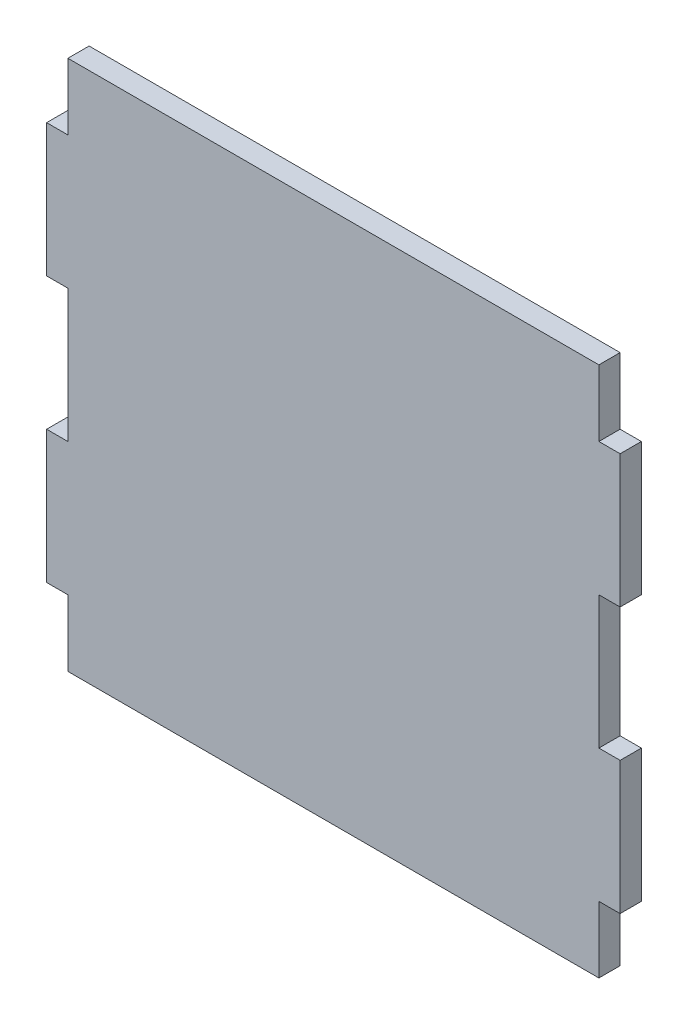
ISO-10303-21;
HEADER;
FILE_DESCRIPTION(('STEP AP214'),'2;1');
FILE_NAME('part.step','',(''),(''),'','','');
FILE_SCHEMA(('AUTOMOTIVE_DESIGN { 1 0 10303 214 1 1 1 1 }'));
ENDSEC;
DATA;
#1=APPLICATION_CONTEXT('core data for automotive mechanical design processes');
#2=APPLICATION_PROTOCOL_DEFINITION('international standard','automotive_design',2000,#1);
#3=PRODUCT_CONTEXT('',#1,'mechanical');
#4=PRODUCT('Part','Part','',(#3));
#5=PRODUCT_RELATED_PRODUCT_CATEGORY('part','',(#4));
#6=PRODUCT_DEFINITION_FORMATION('','',#4);
#7=PRODUCT_DEFINITION_CONTEXT('part definition',#1,'design');
#8=PRODUCT_DEFINITION('design','',#6,#7);
#9=PRODUCT_DEFINITION_SHAPE('','',#8);
#10=(LENGTH_UNIT() NAMED_UNIT(*) SI_UNIT(.MILLI.,.METRE.));
#11=(NAMED_UNIT(*) PLANE_ANGLE_UNIT() SI_UNIT($,.RADIAN.));
#12=(NAMED_UNIT(*) SI_UNIT($,.STERADIAN.) SOLID_ANGLE_UNIT());
#13=UNCERTAINTY_MEASURE_WITH_UNIT(LENGTH_MEASURE(1.E-05),#10,'distance_accuracy_value','');
#14=(GEOMETRIC_REPRESENTATION_CONTEXT(3) GLOBAL_UNCERTAINTY_ASSIGNED_CONTEXT((#13)) GLOBAL_UNIT_ASSIGNED_CONTEXT((#10,
#11,#12)) REPRESENTATION_CONTEXT('',''));
#15=CARTESIAN_POINT('',(0.,0.,0.));
#16=DIRECTION('',(0.,0.,1.));
#17=DIRECTION('',(1.,0.,0.));
#18=AXIS2_PLACEMENT_3D('',#15,#16,#17);
#19=CARTESIAN_POINT('',(0.,0.,4.));
#20=DIRECTION('',(1.,0.,0.));
#21=DIRECTION('',(0.,0.,-1.));
#22=AXIS2_PLACEMENT_3D('',#19,#20,#21);
#23=PLANE('',#22);
#24=DIRECTION('',(0.,-1.,0.));
#25=VECTOR('',#24,1.);
#26=CARTESIAN_POINT('',(0.,0.,0.));
#27=LINE('',#26,#25);
#28=CARTESIAN_POINT('',(0.,0.,0.));
#29=VERTEX_POINT('',#28);
#30=CARTESIAN_POINT('',(0.,-12.5,0.));
#31=VERTEX_POINT('',#30);
#32=EDGE_CURVE('E201',#29,#31,#27,.T.);
#33=ORIENTED_EDGE('',*,*,#32,.T.);
#34=DIRECTION('',(0.,0.,-1.));
#35=VECTOR('',#34,1.);
#36=CARTESIAN_POINT('',(0.,-12.5,4.));
#37=LINE('',#36,#35);
#38=CARTESIAN_POINT('',(0.,-12.5,4.));
#39=VERTEX_POINT('',#38);
#40=EDGE_CURVE('E11',#39,#31,#37,.T.);
#41=ORIENTED_EDGE('',*,*,#40,.F.);
#42=DIRECTION('',(0.,-1.,0.));
#43=VECTOR('',#42,1.);
#44=CARTESIAN_POINT('',(0.,0.,4.));
#45=LINE('',#44,#43);
#46=CARTESIAN_POINT('',(0.,0.,4.));
#47=VERTEX_POINT('',#46);
#48=EDGE_CURVE('E239',#47,#39,#45,.T.);
#49=ORIENTED_EDGE('',*,*,#48,.F.);
#50=DIRECTION('',(0.,0.,-1.));
#51=VECTOR('',#50,1.);
#52=CARTESIAN_POINT('',(0.,0.,4.));
#53=LINE('',#52,#51);
#54=EDGE_CURVE('E197',#47,#29,#53,.T.);
#55=ORIENTED_EDGE('',*,*,#54,.T.);
#56=EDGE_LOOP('',(#33,#41,#49,#55));
#57=FACE_BOUND('',#56,.T.);
#58=ADVANCED_FACE('F33',(#57),#23,.F.);
#59=CARTESIAN_POINT('',(0.,-12.5,4.));
#60=DIRECTION('',(0.,-1.,0.));
#61=DIRECTION('',(1.,0.,0.));
#62=AXIS2_PLACEMENT_3D('',#59,#60,#61);
#63=PLANE('',#62);
#64=DIRECTION('',(-1.,0.,0.));
#65=VECTOR('',#64,1.);
#66=CARTESIAN_POINT('',(0.,-12.5,0.));
#67=LINE('',#66,#65);
#68=CARTESIAN_POINT('',(-4.,-12.5,0.));
#69=VERTEX_POINT('',#68);
#70=EDGE_CURVE('E204',#31,#69,#67,.T.);
#71=ORIENTED_EDGE('',*,*,#70,.T.);
#72=DIRECTION('',(0.,0.,-1.));
#73=VECTOR('',#72,1.);
#74=CARTESIAN_POINT('',(-4.,-12.5,4.));
#75=LINE('',#74,#73);
#76=CARTESIAN_POINT('',(-4.,-12.5,4.));
#77=VERTEX_POINT('',#76);
#78=EDGE_CURVE('E41',#77,#69,#75,.T.);
#79=ORIENTED_EDGE('',*,*,#78,.F.);
#80=DIRECTION('',(-1.,0.,0.));
#81=VECTOR('',#80,1.);
#82=CARTESIAN_POINT('',(0.,-12.5,4.));
#83=LINE('',#82,#81);
#84=EDGE_CURVE('E128',#39,#77,#83,.T.);
#85=ORIENTED_EDGE('',*,*,#84,.F.);
#86=ORIENTED_EDGE('',*,*,#40,.T.);
#87=EDGE_LOOP('',(#71,#79,#85,#86));
#88=FACE_BOUND('',#87,.T.);
#89=ADVANCED_FACE('F357',(#88),#63,.F.);
#90=CARTESIAN_POINT('',(-4.,-12.5,4.));
#91=DIRECTION('',(1.,0.,0.));
#92=DIRECTION('',(0.,1.,0.));
#93=AXIS2_PLACEMENT_3D('',#90,#91,#92);
#94=PLANE('',#93);
#95=DIRECTION('',(0.,-1.,0.));
#96=VECTOR('',#95,1.);
#97=CARTESIAN_POINT('',(-4.,-12.5,0.));
#98=LINE('',#97,#96);
#99=CARTESIAN_POINT('',(-4.,-37.5,0.));
#100=VERTEX_POINT('',#99);
#101=EDGE_CURVE('E206',#69,#100,#98,.T.);
#102=ORIENTED_EDGE('',*,*,#101,.T.);
#103=DIRECTION('',(0.,0.,-1.));
#104=VECTOR('',#103,1.);
#105=CARTESIAN_POINT('',(-4.,-37.5,4.));
#106=LINE('',#105,#104);
#107=CARTESIAN_POINT('',(-4.,-37.5,4.));
#108=VERTEX_POINT('',#107);
#109=EDGE_CURVE('E282',#108,#100,#106,.T.);
#110=ORIENTED_EDGE('',*,*,#109,.F.);
#111=DIRECTION('',(0.,-1.,0.));
#112=VECTOR('',#111,1.);
#113=CARTESIAN_POINT('',(-4.,-12.5,4.));
#114=LINE('',#113,#112);
#115=EDGE_CURVE('E290',#77,#108,#114,.T.);
#116=ORIENTED_EDGE('',*,*,#115,.F.);
#117=ORIENTED_EDGE('',*,*,#78,.T.);
#118=EDGE_LOOP('',(#102,#110,#116,#117));
#119=FACE_BOUND('',#118,.T.);
#120=ADVANCED_FACE('F288',(#119),#94,.F.);
#121=CARTESIAN_POINT('',(0.,-37.5,4.));
#122=DIRECTION('',(0.,1.,0.));
#123=DIRECTION('',(0.,0.,1.));
#124=AXIS2_PLACEMENT_3D('',#121,#122,#123);
#125=PLANE('',#124);
#126=DIRECTION('',(1.,0.,0.));
#127=VECTOR('',#126,1.);
#128=CARTESIAN_POINT('',(0.,-37.5,0.));
#129=LINE('',#128,#127);
#130=CARTESIAN_POINT('',(0.,-37.5,0.));
#131=VERTEX_POINT('',#130);
#132=EDGE_CURVE('E208',#100,#131,#129,.T.);
#133=ORIENTED_EDGE('',*,*,#132,.T.);
#134=DIRECTION('',(0.,0.,-1.));
#135=VECTOR('',#134,1.);
#136=CARTESIAN_POINT('',(0.,-37.5,4.));
#137=LINE('',#136,#135);
#138=CARTESIAN_POINT('',(0.,-37.5,4.));
#139=VERTEX_POINT('',#138);
#140=EDGE_CURVE('E279',#139,#131,#137,.T.);
#141=ORIENTED_EDGE('',*,*,#140,.F.);
#142=DIRECTION('',(1.,0.,0.));
#143=VECTOR('',#142,1.);
#144=CARTESIAN_POINT('',(0.,-37.5,4.));
#145=LINE('',#144,#143);
#146=EDGE_CURVE('E308',#108,#139,#145,.T.);
#147=ORIENTED_EDGE('',*,*,#146,.F.);
#148=ORIENTED_EDGE('',*,*,#109,.T.);
#149=EDGE_LOOP('',(#133,#141,#147,#148));
#150=FACE_BOUND('',#149,.T.);
#151=ADVANCED_FACE('F299',(#150),#125,.F.);
#152=CARTESIAN_POINT('',(0.,-37.5,4.));
#153=DIRECTION('',(1.,0.,0.));
#154=DIRECTION('',(0.,1.,0.));
#155=AXIS2_PLACEMENT_3D('',#152,#153,#154);
#156=PLANE('',#155);
#157=DIRECTION('',(0.,-1.,0.));
#158=VECTOR('',#157,1.);
#159=CARTESIAN_POINT('',(0.,-37.5,0.));
#160=LINE('',#159,#158);
#161=CARTESIAN_POINT('',(0.,-62.5,0.));
#162=VERTEX_POINT('',#161);
#163=EDGE_CURVE('E210',#131,#162,#160,.T.);
#164=ORIENTED_EDGE('',*,*,#163,.T.);
#165=DIRECTION('',(0.,0.,-1.));
#166=VECTOR('',#165,1.);
#167=CARTESIAN_POINT('',(0.,-62.5,4.));
#168=LINE('',#167,#166);
#169=CARTESIAN_POINT('',(0.,-62.5,4.));
#170=VERTEX_POINT('',#169);
#171=EDGE_CURVE('E276',#170,#162,#168,.T.);
#172=ORIENTED_EDGE('',*,*,#171,.F.);
#173=DIRECTION('',(0.,-1.,0.));
#174=VECTOR('',#173,1.);
#175=CARTESIAN_POINT('',(0.,-37.5,4.));
#176=LINE('',#175,#174);
#177=EDGE_CURVE('E305',#139,#170,#176,.T.);
#178=ORIENTED_EDGE('',*,*,#177,.F.);
#179=ORIENTED_EDGE('',*,*,#140,.T.);
#180=EDGE_LOOP('',(#164,#172,#178,#179));
#181=FACE_BOUND('',#180,.T.);
#182=ADVANCED_FACE('F303',(#181),#156,.F.);
#183=CARTESIAN_POINT('',(0.,-62.5,4.));
#184=DIRECTION('',(0.,-1.,0.));
#185=DIRECTION('',(0.,0.,-1.));
#186=AXIS2_PLACEMENT_3D('',#183,#184,#185);
#187=PLANE('',#186);
#188=DIRECTION('',(-1.,0.,0.));
#189=VECTOR('',#188,1.);
#190=CARTESIAN_POINT('',(0.,-62.5,0.));
#191=LINE('',#190,#189);
#192=CARTESIAN_POINT('',(-3.99999999999999,-62.5,0.));
#193=VERTEX_POINT('',#192);
#194=EDGE_CURVE('E212',#162,#193,#191,.T.);
#195=ORIENTED_EDGE('',*,*,#194,.T.);
#196=DIRECTION('',(0.,0.,-1.));
#197=VECTOR('',#196,1.);
#198=CARTESIAN_POINT('',(-3.99999999999999,-62.5,4.));
#199=LINE('',#198,#197);
#200=CARTESIAN_POINT('',(-3.99999999999999,-62.5,4.));
#201=VERTEX_POINT('',#200);
#202=EDGE_CURVE('E273',#201,#193,#199,.T.);
#203=ORIENTED_EDGE('',*,*,#202,.F.);
#204=DIRECTION('',(-1.,0.,0.));
#205=VECTOR('',#204,1.);
#206=CARTESIAN_POINT('',(0.,-62.5,4.));
#207=LINE('',#206,#205);
#208=EDGE_CURVE('E307',#170,#201,#207,.T.);
#209=ORIENTED_EDGE('',*,*,#208,.F.);
#210=ORIENTED_EDGE('',*,*,#171,.T.);
#211=EDGE_LOOP('',(#195,#203,#209,#210));
#212=FACE_BOUND('',#211,.T.);
#213=ADVANCED_FACE('F370',(#212),#187,.F.);
#214=CARTESIAN_POINT('',(-3.99999999999999,-62.5,4.));
#215=DIRECTION('',(1.,0.,0.));
#216=DIRECTION('',(0.,1.,0.));
#217=AXIS2_PLACEMENT_3D('',#214,#215,#216);
#218=PLANE('',#217);
#219=DIRECTION('',(0.,-1.,0.));
#220=VECTOR('',#219,1.);
#221=CARTESIAN_POINT('',(-3.99999999999999,-62.5,0.));
#222=LINE('',#221,#220);
#223=CARTESIAN_POINT('',(-3.99999999999999,-87.5,0.));
#224=VERTEX_POINT('',#223);
#225=EDGE_CURVE('E214',#193,#224,#222,.T.);
#226=ORIENTED_EDGE('',*,*,#225,.T.);
#227=DIRECTION('',(0.,0.,-1.));
#228=VECTOR('',#227,1.);
#229=CARTESIAN_POINT('',(-3.99999999999999,-87.5,4.));
#230=LINE('',#229,#228);
#231=CARTESIAN_POINT('',(-3.99999999999999,-87.5,4.));
#232=VERTEX_POINT('',#231);
#233=EDGE_CURVE('E270',#232,#224,#230,.T.);
#234=ORIENTED_EDGE('',*,*,#233,.F.);
#235=DIRECTION('',(0.,-1.,0.));
#236=VECTOR('',#235,1.);
#237=CARTESIAN_POINT('',(-3.99999999999999,-62.5,4.));
#238=LINE('',#237,#236);
#239=EDGE_CURVE('E310',#201,#232,#238,.T.);
#240=ORIENTED_EDGE('',*,*,#239,.F.);
#241=ORIENTED_EDGE('',*,*,#202,.T.);
#242=EDGE_LOOP('',(#226,#234,#240,#241));
#243=FACE_BOUND('',#242,.T.);
#244=ADVANCED_FACE('F373',(#243),#218,.F.);
#245=CARTESIAN_POINT('',(0.,-87.5,4.));
#246=DIRECTION('',(0.,1.,0.));
#247=DIRECTION('',(0.,0.,1.));
#248=AXIS2_PLACEMENT_3D('',#245,#246,#247);
#249=PLANE('',#248);
#250=DIRECTION('',(1.,0.,0.));
#251=VECTOR('',#250,1.);
#252=CARTESIAN_POINT('',(0.,-87.5,0.));
#253=LINE('',#252,#251);
#254=CARTESIAN_POINT('',(0.,-87.5,0.));
#255=VERTEX_POINT('',#254);
#256=EDGE_CURVE('E216',#224,#255,#253,.T.);
#257=ORIENTED_EDGE('',*,*,#256,.T.);
#258=DIRECTION('',(0.,0.,-1.));
#259=VECTOR('',#258,1.);
#260=CARTESIAN_POINT('',(0.,-87.5,4.));
#261=LINE('',#260,#259);
#262=CARTESIAN_POINT('',(0.,-87.5,4.));
#263=VERTEX_POINT('',#262);
#264=EDGE_CURVE('E267',#263,#255,#261,.T.);
#265=ORIENTED_EDGE('',*,*,#264,.F.);
#266=DIRECTION('',(1.,0.,0.));
#267=VECTOR('',#266,1.);
#268=CARTESIAN_POINT('',(0.,-87.5,4.));
#269=LINE('',#268,#267);
#270=EDGE_CURVE('E316',#232,#263,#269,.T.);
#271=ORIENTED_EDGE('',*,*,#270,.F.);
#272=ORIENTED_EDGE('',*,*,#233,.T.);
#273=EDGE_LOOP('',(#257,#265,#271,#272));
#274=FACE_BOUND('',#273,.T.);
#275=ADVANCED_FACE('F377',(#274),#249,.F.);
#276=CARTESIAN_POINT('',(0.,-87.5,4.));
#277=DIRECTION('',(1.,0.,0.));
#278=DIRECTION('',(0.,1.,0.));
#279=AXIS2_PLACEMENT_3D('',#276,#277,#278);
#280=PLANE('',#279);
#281=DIRECTION('',(0.,-1.,0.));
#282=VECTOR('',#281,1.);
#283=CARTESIAN_POINT('',(0.,-87.5,0.));
#284=LINE('',#283,#282);
#285=CARTESIAN_POINT('',(0.,-100.,0.));
#286=VERTEX_POINT('',#285);
#287=EDGE_CURVE('E218',#255,#286,#284,.T.);
#288=ORIENTED_EDGE('',*,*,#287,.T.);
#289=DIRECTION('',(0.,0.,-1.));
#290=VECTOR('',#289,1.);
#291=CARTESIAN_POINT('',(0.,-100.,4.));
#292=LINE('',#291,#290);
#293=CARTESIAN_POINT('',(0.,-100.,4.));
#294=VERTEX_POINT('',#293);
#295=EDGE_CURVE('E264',#294,#286,#292,.T.);
#296=ORIENTED_EDGE('',*,*,#295,.F.);
#297=DIRECTION('',(0.,-1.,0.));
#298=VECTOR('',#297,1.);
#299=CARTESIAN_POINT('',(0.,-87.5,4.));
#300=LINE('',#299,#298);
#301=EDGE_CURVE('E318',#263,#294,#300,.T.);
#302=ORIENTED_EDGE('',*,*,#301,.F.);
#303=ORIENTED_EDGE('',*,*,#264,.T.);
#304=EDGE_LOOP('',(#288,#296,#302,#303));
#305=FACE_BOUND('',#304,.T.);
#306=ADVANCED_FACE('F381',(#305),#280,.F.);
#307=CARTESIAN_POINT('',(0.,-100.,4.));
#308=DIRECTION('',(0.,1.,0.));
#309=DIRECTION('',(0.,0.,1.));
#310=AXIS2_PLACEMENT_3D('',#307,#308,#309);
#311=PLANE('',#310);
#312=DIRECTION('',(1.,0.,0.));
#313=VECTOR('',#312,1.);
#314=CARTESIAN_POINT('',(0.,-100.,0.));
#315=LINE('',#314,#313);
#316=CARTESIAN_POINT('',(100.,-100.,0.));
#317=VERTEX_POINT('',#316);
#318=EDGE_CURVE('E220',#286,#317,#315,.T.);
#319=ORIENTED_EDGE('',*,*,#318,.T.);
#320=DIRECTION('',(0.,0.,-1.));
#321=VECTOR('',#320,1.);
#322=CARTESIAN_POINT('',(100.,-100.,4.));
#323=LINE('',#322,#321);
#324=CARTESIAN_POINT('',(100.,-100.,4.));
#325=VERTEX_POINT('',#324);
#326=EDGE_CURVE('E261',#325,#317,#323,.T.);
#327=ORIENTED_EDGE('',*,*,#326,.F.);
#328=DIRECTION('',(1.,0.,0.));
#329=VECTOR('',#328,1.);
#330=CARTESIAN_POINT('',(0.,-100.,4.));
#331=LINE('',#330,#329);
#332=EDGE_CURVE('E320',#294,#325,#331,.T.);
#333=ORIENTED_EDGE('',*,*,#332,.F.);
#334=ORIENTED_EDGE('',*,*,#295,.T.);
#335=EDGE_LOOP('',(#319,#327,#333,#334));
#336=FACE_BOUND('',#335,.T.);
#337=ADVANCED_FACE('F385',(#336),#311,.F.);
#338=CARTESIAN_POINT('',(100.,-87.5,4.));
#339=DIRECTION('',(-1.,0.,0.));
#340=DIRECTION('',(0.,-1.,0.));
#341=AXIS2_PLACEMENT_3D('',#338,#339,#340);
#342=PLANE('',#341);
#343=DIRECTION('',(0.,1.,0.));
#344=VECTOR('',#343,1.);
#345=CARTESIAN_POINT('',(100.,-87.5,0.));
#346=LINE('',#345,#344);
#347=CARTESIAN_POINT('',(100.,-87.5,0.));
#348=VERTEX_POINT('',#347);
#349=EDGE_CURVE('E222',#317,#348,#346,.T.);
#350=ORIENTED_EDGE('',*,*,#349,.T.);
#351=DIRECTION('',(0.,0.,-1.));
#352=VECTOR('',#351,1.);
#353=CARTESIAN_POINT('',(100.,-87.5,4.));
#354=LINE('',#353,#352);
#355=CARTESIAN_POINT('',(100.,-87.5,4.));
#356=VERTEX_POINT('',#355);
#357=EDGE_CURVE('E258',#356,#348,#354,.T.);
#358=ORIENTED_EDGE('',*,*,#357,.F.);
#359=DIRECTION('',(0.,1.,0.));
#360=VECTOR('',#359,1.);
#361=CARTESIAN_POINT('',(100.,-87.5,4.));
#362=LINE('',#361,#360);
#363=EDGE_CURVE('E322',#325,#356,#362,.T.);
#364=ORIENTED_EDGE('',*,*,#363,.F.);
#365=ORIENTED_EDGE('',*,*,#326,.T.);
#366=EDGE_LOOP('',(#350,#358,#364,#365));
#367=FACE_BOUND('',#366,.T.);
#368=ADVANCED_FACE('F389',(#367),#342,.F.);
#369=CARTESIAN_POINT('',(100.,-87.5,4.));
#370=DIRECTION('',(0.,1.,0.));
#371=DIRECTION('',(0.,0.,1.));
#372=AXIS2_PLACEMENT_3D('',#369,#370,#371);
#373=PLANE('',#372);
#374=DIRECTION('',(1.,0.,0.));
#375=VECTOR('',#374,1.);
#376=CARTESIAN_POINT('',(100.,-87.5,0.));
#377=LINE('',#376,#375);
#378=CARTESIAN_POINT('',(104.,-87.5,0.));
#379=VERTEX_POINT('',#378);
#380=EDGE_CURVE('E224',#348,#379,#377,.T.);
#381=ORIENTED_EDGE('',*,*,#380,.T.);
#382=DIRECTION('',(0.,0.,-1.));
#383=VECTOR('',#382,1.);
#384=CARTESIAN_POINT('',(104.,-87.5,4.));
#385=LINE('',#384,#383);
#386=CARTESIAN_POINT('',(104.,-87.5,4.));
#387=VERTEX_POINT('',#386);
#388=EDGE_CURVE('E255',#387,#379,#385,.T.);
#389=ORIENTED_EDGE('',*,*,#388,.F.);
#390=DIRECTION('',(1.,0.,0.));
#391=VECTOR('',#390,1.);
#392=CARTESIAN_POINT('',(100.,-87.5,4.));
#393=LINE('',#392,#391);
#394=EDGE_CURVE('E324',#356,#387,#393,.T.);
#395=ORIENTED_EDGE('',*,*,#394,.F.);
#396=ORIENTED_EDGE('',*,*,#357,.T.);
#397=EDGE_LOOP('',(#381,#389,#395,#396));
#398=FACE_BOUND('',#397,.T.);
#399=ADVANCED_FACE('F393',(#398),#373,.F.);
#400=CARTESIAN_POINT('',(104.,-62.5,4.));
#401=DIRECTION('',(-1.,0.,0.));
#402=DIRECTION('',(0.,0.,1.));
#403=AXIS2_PLACEMENT_3D('',#400,#401,#402);
#404=PLANE('',#403);
#405=DIRECTION('',(0.,1.,0.));
#406=VECTOR('',#405,1.);
#407=CARTESIAN_POINT('',(104.,-62.5,0.));
#408=LINE('',#407,#406);
#409=CARTESIAN_POINT('',(104.,-62.5,0.));
#410=VERTEX_POINT('',#409);
#411=EDGE_CURVE('E226',#379,#410,#408,.T.);
#412=ORIENTED_EDGE('',*,*,#411,.T.);
#413=DIRECTION('',(0.,0.,-1.));
#414=VECTOR('',#413,1.);
#415=CARTESIAN_POINT('',(104.,-62.5,4.));
#416=LINE('',#415,#414);
#417=CARTESIAN_POINT('',(104.,-62.5,4.));
#418=VERTEX_POINT('',#417);
#419=EDGE_CURVE('E252',#418,#410,#416,.T.);
#420=ORIENTED_EDGE('',*,*,#419,.F.);
#421=DIRECTION('',(0.,1.,0.));
#422=VECTOR('',#421,1.);
#423=CARTESIAN_POINT('',(104.,-62.5,4.));
#424=LINE('',#423,#422);
#425=EDGE_CURVE('E326',#387,#418,#424,.T.);
#426=ORIENTED_EDGE('',*,*,#425,.F.);
#427=ORIENTED_EDGE('',*,*,#388,.T.);
#428=EDGE_LOOP('',(#412,#420,#426,#427));
#429=FACE_BOUND('',#428,.T.);
#430=ADVANCED_FACE('F397',(#429),#404,.F.);
#431=CARTESIAN_POINT('',(100.,-62.5,4.));
#432=DIRECTION('',(0.,-1.,0.));
#433=DIRECTION('',(0.,0.,-1.));
#434=AXIS2_PLACEMENT_3D('',#431,#432,#433);
#435=PLANE('',#434);
#436=DIRECTION('',(-1.,0.,0.));
#437=VECTOR('',#436,1.);
#438=CARTESIAN_POINT('',(100.,-62.5,0.));
#439=LINE('',#438,#437);
#440=CARTESIAN_POINT('',(100.,-62.5,0.));
#441=VERTEX_POINT('',#440);
#442=EDGE_CURVE('E228',#410,#441,#439,.T.);
#443=ORIENTED_EDGE('',*,*,#442,.T.);
#444=DIRECTION('',(0.,0.,-1.));
#445=VECTOR('',#444,1.);
#446=CARTESIAN_POINT('',(100.,-62.5,4.));
#447=LINE('',#446,#445);
#448=CARTESIAN_POINT('',(100.,-62.5,4.));
#449=VERTEX_POINT('',#448);
#450=EDGE_CURVE('E249',#449,#441,#447,.T.);
#451=ORIENTED_EDGE('',*,*,#450,.F.);
#452=DIRECTION('',(-1.,0.,0.));
#453=VECTOR('',#452,1.);
#454=CARTESIAN_POINT('',(100.,-62.5,4.));
#455=LINE('',#454,#453);
#456=EDGE_CURVE('E328',#418,#449,#455,.T.);
#457=ORIENTED_EDGE('',*,*,#456,.F.);
#458=ORIENTED_EDGE('',*,*,#419,.T.);
#459=EDGE_LOOP('',(#443,#451,#457,#458));
#460=FACE_BOUND('',#459,.T.);
#461=ADVANCED_FACE('F401',(#460),#435,.F.);
#462=CARTESIAN_POINT('',(100.,-37.5,4.));
#463=DIRECTION('',(-1.,0.,0.));
#464=DIRECTION('',(0.,0.,1.));
#465=AXIS2_PLACEMENT_3D('',#462,#463,#464);
#466=PLANE('',#465);
#467=DIRECTION('',(0.,1.,0.));
#468=VECTOR('',#467,1.);
#469=CARTESIAN_POINT('',(100.,-37.5,0.));
#470=LINE('',#469,#468);
#471=CARTESIAN_POINT('',(100.,-37.5,0.));
#472=VERTEX_POINT('',#471);
#473=EDGE_CURVE('E230',#441,#472,#470,.T.);
#474=ORIENTED_EDGE('',*,*,#473,.T.);
#475=DIRECTION('',(0.,0.,-1.));
#476=VECTOR('',#475,1.);
#477=CARTESIAN_POINT('',(100.,-37.5,4.));
#478=LINE('',#477,#476);
#479=CARTESIAN_POINT('',(100.,-37.5,4.));
#480=VERTEX_POINT('',#479);
#481=EDGE_CURVE('E246',#480,#472,#478,.T.);
#482=ORIENTED_EDGE('',*,*,#481,.F.);
#483=DIRECTION('',(0.,1.,0.));
#484=VECTOR('',#483,1.);
#485=CARTESIAN_POINT('',(100.,-37.5,4.));
#486=LINE('',#485,#484);
#487=EDGE_CURVE('E330',#449,#480,#486,.T.);
#488=ORIENTED_EDGE('',*,*,#487,.F.);
#489=ORIENTED_EDGE('',*,*,#450,.T.);
#490=EDGE_LOOP('',(#474,#482,#488,#489));
#491=FACE_BOUND('',#490,.T.);
#492=ADVANCED_FACE('F405',(#491),#466,.F.);
#493=CARTESIAN_POINT('',(100.,-37.5,4.));
#494=DIRECTION('',(0.,1.,0.));
#495=DIRECTION('',(-1.,0.,0.));
#496=AXIS2_PLACEMENT_3D('',#493,#494,#495);
#497=PLANE('',#496);
#498=DIRECTION('',(1.,0.,0.));
#499=VECTOR('',#498,1.);
#500=CARTESIAN_POINT('',(100.,-37.5,0.));
#501=LINE('',#500,#499);
#502=CARTESIAN_POINT('',(104.,-37.5,0.));
#503=VERTEX_POINT('',#502);
#504=EDGE_CURVE('E232',#472,#503,#501,.T.);
#505=ORIENTED_EDGE('',*,*,#504,.T.);
#506=DIRECTION('',(0.,0.,-1.));
#507=VECTOR('',#506,1.);
#508=CARTESIAN_POINT('',(104.,-37.5,4.));
#509=LINE('',#508,#507);
#510=CARTESIAN_POINT('',(104.,-37.5,4.));
#511=VERTEX_POINT('',#510);
#512=EDGE_CURVE('E243',#511,#503,#509,.T.);
#513=ORIENTED_EDGE('',*,*,#512,.F.);
#514=DIRECTION('',(1.,0.,0.));
#515=VECTOR('',#514,1.);
#516=CARTESIAN_POINT('',(100.,-37.5,4.));
#517=LINE('',#516,#515);
#518=EDGE_CURVE('E332',#480,#511,#517,.T.);
#519=ORIENTED_EDGE('',*,*,#518,.F.);
#520=ORIENTED_EDGE('',*,*,#481,.T.);
#521=EDGE_LOOP('',(#505,#513,#519,#520));
#522=FACE_BOUND('',#521,.T.);
#523=ADVANCED_FACE('F338',(#522),#497,.F.);
#524=CARTESIAN_POINT('',(104.,-12.5,4.));
#525=DIRECTION('',(-1.,0.,0.));
#526=DIRECTION('',(0.,-1.,0.));
#527=AXIS2_PLACEMENT_3D('',#524,#525,#526);
#528=PLANE('',#527);
#529=DIRECTION('',(0.,1.,0.));
#530=VECTOR('',#529,1.);
#531=CARTESIAN_POINT('',(104.,-12.5,0.));
#532=LINE('',#531,#530);
#533=CARTESIAN_POINT('',(104.,-12.5,0.));
#534=VERTEX_POINT('',#533);
#535=EDGE_CURVE('E234',#503,#534,#532,.T.);
#536=ORIENTED_EDGE('',*,*,#535,.T.);
#537=DIRECTION('',(0.,0.,-1.));
#538=VECTOR('',#537,1.);
#539=CARTESIAN_POINT('',(104.,-12.5,4.));
#540=LINE('',#539,#538);
#541=CARTESIAN_POINT('',(104.,-12.5,4.));
#542=VERTEX_POINT('',#541);
#543=EDGE_CURVE('E192',#542,#534,#540,.T.);
#544=ORIENTED_EDGE('',*,*,#543,.F.);
#545=DIRECTION('',(0.,1.,0.));
#546=VECTOR('',#545,1.);
#547=CARTESIAN_POINT('',(104.,-12.5,4.));
#548=LINE('',#547,#546);
#549=EDGE_CURVE('E183',#511,#542,#548,.T.);
#550=ORIENTED_EDGE('',*,*,#549,.F.);
#551=ORIENTED_EDGE('',*,*,#512,.T.);
#552=EDGE_LOOP('',(#536,#544,#550,#551));
#553=FACE_BOUND('',#552,.T.);
#554=ADVANCED_FACE('F342',(#553),#528,.F.);
#555=CARTESIAN_POINT('',(100.,-12.5,4.));
#556=DIRECTION('',(0.,-1.,0.));
#557=DIRECTION('',(1.,0.,0.));
#558=AXIS2_PLACEMENT_3D('',#555,#556,#557);
#559=PLANE('',#558);
#560=DIRECTION('',(-1.,0.,0.));
#561=VECTOR('',#560,1.);
#562=CARTESIAN_POINT('',(100.,-12.5,0.));
#563=LINE('',#562,#561);
#564=CARTESIAN_POINT('',(100.,-12.5,0.));
#565=VERTEX_POINT('',#564);
#566=EDGE_CURVE('E191',#534,#565,#563,.T.);
#567=ORIENTED_EDGE('',*,*,#566,.T.);
#568=DIRECTION('',(0.,0.,-1.));
#569=VECTOR('',#568,1.);
#570=CARTESIAN_POINT('',(100.,-12.5,4.));
#571=LINE('',#570,#569);
#572=CARTESIAN_POINT('',(100.,-12.5,4.));
#573=VERTEX_POINT('',#572);
#574=EDGE_CURVE('E188',#573,#565,#571,.T.);
#575=ORIENTED_EDGE('',*,*,#574,.F.);
#576=DIRECTION('',(-1.,0.,0.));
#577=VECTOR('',#576,1.);
#578=CARTESIAN_POINT('',(100.,-12.5,4.));
#579=LINE('',#578,#577);
#580=EDGE_CURVE('E177',#542,#573,#579,.T.);
#581=ORIENTED_EDGE('',*,*,#580,.F.);
#582=ORIENTED_EDGE('',*,*,#543,.T.);
#583=EDGE_LOOP('',(#567,#575,#581,#582));
#584=FACE_BOUND('',#583,.T.);
#585=ADVANCED_FACE('F189',(#584),#559,.F.);
#586=CARTESIAN_POINT('',(100.,0.,4.));
#587=DIRECTION('',(-1.,0.,0.));
#588=DIRECTION('',(0.,0.,1.));
#589=AXIS2_PLACEMENT_3D('',#586,#587,#588);
#590=PLANE('',#589);
#591=DIRECTION('',(0.,1.,0.));
#592=VECTOR('',#591,1.);
#593=CARTESIAN_POINT('',(100.,0.,0.));
#594=LINE('',#593,#592);
#595=CARTESIAN_POINT('',(100.,0.,0.));
#596=VERTEX_POINT('',#595);
#597=EDGE_CURVE('E114',#565,#596,#594,.T.);
#598=ORIENTED_EDGE('',*,*,#597,.T.);
#599=DIRECTION('',(0.,0.,-1.));
#600=VECTOR('',#599,1.);
#601=CARTESIAN_POINT('',(100.,0.,4.));
#602=LINE('',#601,#600);
#603=CARTESIAN_POINT('',(100.,0.,4.));
#604=VERTEX_POINT('',#603);
#605=EDGE_CURVE('E193',#604,#596,#602,.T.);
#606=ORIENTED_EDGE('',*,*,#605,.F.);
#607=DIRECTION('',(0.,1.,0.));
#608=VECTOR('',#607,1.);
#609=CARTESIAN_POINT('',(100.,0.,4.));
#610=LINE('',#609,#608);
#611=EDGE_CURVE('E181',#573,#604,#610,.T.);
#612=ORIENTED_EDGE('',*,*,#611,.F.);
#613=ORIENTED_EDGE('',*,*,#574,.T.);
#614=EDGE_LOOP('',(#598,#606,#612,#613));
#615=FACE_BOUND('',#614,.T.);
#616=ADVANCED_FACE('F195',(#615),#590,.F.);
#617=CARTESIAN_POINT('',(0.,0.,4.));
#618=DIRECTION('',(0.,-1.,0.));
#619=DIRECTION('',(0.,0.,-1.));
#620=AXIS2_PLACEMENT_3D('',#617,#618,#619);
#621=PLANE('',#620);
#622=DIRECTION('',(-1.,0.,0.));
#623=VECTOR('',#622,1.);
#624=CARTESIAN_POINT('',(0.,0.,0.));
#625=LINE('',#624,#623);
#626=EDGE_CURVE('E120',#596,#29,#625,.T.);
#627=ORIENTED_EDGE('',*,*,#626,.T.);
#628=ORIENTED_EDGE('',*,*,#54,.F.);
#629=DIRECTION('',(-1.,0.,0.));
#630=VECTOR('',#629,1.);
#631=CARTESIAN_POINT('',(0.,0.,4.));
#632=LINE('',#631,#630);
#633=EDGE_CURVE('E49',#604,#47,#632,.T.);
#634=ORIENTED_EDGE('',*,*,#633,.F.);
#635=ORIENTED_EDGE('',*,*,#605,.T.);
#636=EDGE_LOOP('',(#627,#628,#634,#635));
#637=FACE_BOUND('',#636,.T.);
#638=ADVANCED_FACE('F346',(#637),#621,.F.);
#639=CARTESIAN_POINT('',(0.,0.,4.));
#640=DIRECTION('',(0.,0.,-1.));
#641=DIRECTION('',(-1.,0.,0.));
#642=AXIS2_PLACEMENT_3D('',#639,#640,#641);
#643=PLANE('',#642);
#644=ORIENTED_EDGE('',*,*,#48,.T.);
#645=ORIENTED_EDGE('',*,*,#84,.T.);
#646=ORIENTED_EDGE('',*,*,#115,.T.);
#647=ORIENTED_EDGE('',*,*,#146,.T.);
#648=ORIENTED_EDGE('',*,*,#177,.T.);
#649=ORIENTED_EDGE('',*,*,#208,.T.);
#650=ORIENTED_EDGE('',*,*,#239,.T.);
#651=ORIENTED_EDGE('',*,*,#270,.T.);
#652=ORIENTED_EDGE('',*,*,#301,.T.);
#653=ORIENTED_EDGE('',*,*,#332,.T.);
#654=ORIENTED_EDGE('',*,*,#363,.T.);
#655=ORIENTED_EDGE('',*,*,#394,.T.);
#656=ORIENTED_EDGE('',*,*,#425,.T.);
#657=ORIENTED_EDGE('',*,*,#456,.T.);
#658=ORIENTED_EDGE('',*,*,#487,.T.);
#659=ORIENTED_EDGE('',*,*,#518,.T.);
#660=ORIENTED_EDGE('',*,*,#549,.T.);
#661=ORIENTED_EDGE('',*,*,#580,.T.);
#662=ORIENTED_EDGE('',*,*,#611,.T.);
#663=ORIENTED_EDGE('',*,*,#633,.T.);
#664=EDGE_LOOP('',(#644,#645,#646,#647,#648,#649,#650,#651,#652,#653,#654,#655,#656,#657,#658,
#659,#660,#661,#662,#663));
#665=FACE_BOUND('',#664,.T.);
#666=ADVANCED_FACE('F179',(#665),#643,.F.);
#667=CARTESIAN_POINT('',(0.,0.,0.));
#668=DIRECTION('',(0.,0.,-1.));
#669=DIRECTION('',(-1.,0.,0.));
#670=AXIS2_PLACEMENT_3D('',#667,#668,#669);
#671=PLANE('',#670);
#672=ORIENTED_EDGE('',*,*,#32,.F.);
#673=ORIENTED_EDGE('',*,*,#626,.F.);
#674=ORIENTED_EDGE('',*,*,#597,.F.);
#675=ORIENTED_EDGE('',*,*,#566,.F.);
#676=ORIENTED_EDGE('',*,*,#535,.F.);
#677=ORIENTED_EDGE('',*,*,#504,.F.);
#678=ORIENTED_EDGE('',*,*,#473,.F.);
#679=ORIENTED_EDGE('',*,*,#442,.F.);
#680=ORIENTED_EDGE('',*,*,#411,.F.);
#681=ORIENTED_EDGE('',*,*,#380,.F.);
#682=ORIENTED_EDGE('',*,*,#349,.F.);
#683=ORIENTED_EDGE('',*,*,#318,.F.);
#684=ORIENTED_EDGE('',*,*,#287,.F.);
#685=ORIENTED_EDGE('',*,*,#256,.F.);
#686=ORIENTED_EDGE('',*,*,#225,.F.);
#687=ORIENTED_EDGE('',*,*,#194,.F.);
#688=ORIENTED_EDGE('',*,*,#163,.F.);
#689=ORIENTED_EDGE('',*,*,#132,.F.);
#690=ORIENTED_EDGE('',*,*,#101,.F.);
#691=ORIENTED_EDGE('',*,*,#70,.F.);
#692=EDGE_LOOP('',(#672,#673,#674,#675,#676,#677,#678,#679,#680,#681,#682,#683,#684,#685,#686,
#687,#688,#689,#690,#691));
#693=FACE_BOUND('',#692,.T.);
#694=ADVANCED_FACE('F294',(#693),#671,.T.);
#695=CLOSED_SHELL('',(#58,#89,#120,#151,#182,#213,#244,#275,#306,#337,#368,#399,#430,#461,#492,
#523,#554,#585,#616,#638,#666,#694));
#696=MANIFOLD_SOLID_BREP('B2',#695);
#697=ADVANCED_BREP_SHAPE_REPRESENTATION('',(#18,#696),#14);
#698=SHAPE_DEFINITION_REPRESENTATION(#9,#697);
ENDSEC;
END-ISO-10303-21;
